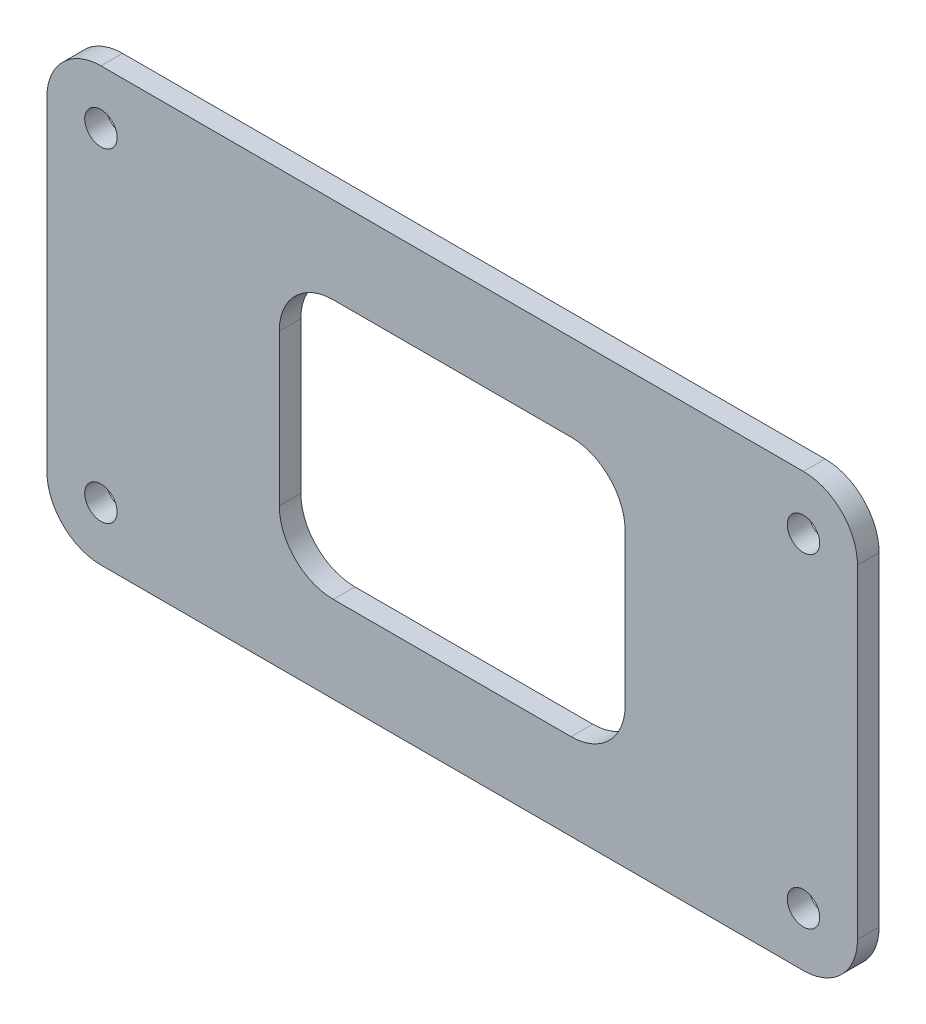
ISO-10303-21;
HEADER;
FILE_DESCRIPTION(('STEP AP214'),'2;1');
FILE_NAME('part.step','',(''),(''),'','','');
FILE_SCHEMA(('AUTOMOTIVE_DESIGN { 1 0 10303 214 1 1 1 1 }'));
ENDSEC;
DATA;
#1=APPLICATION_CONTEXT('core data for automotive mechanical design processes');
#2=APPLICATION_PROTOCOL_DEFINITION('international standard','automotive_design',2000,#1);
#3=PRODUCT_CONTEXT('',#1,'mechanical');
#4=PRODUCT('Part','Part','',(#3));
#5=PRODUCT_RELATED_PRODUCT_CATEGORY('part','',(#4));
#6=PRODUCT_DEFINITION_FORMATION('','',#4);
#7=PRODUCT_DEFINITION_CONTEXT('part definition',#1,'design');
#8=PRODUCT_DEFINITION('design','',#6,#7);
#9=PRODUCT_DEFINITION_SHAPE('','',#8);
#10=(LENGTH_UNIT() NAMED_UNIT(*) SI_UNIT(.MILLI.,.METRE.));
#11=(NAMED_UNIT(*) PLANE_ANGLE_UNIT() SI_UNIT($,.RADIAN.));
#12=(NAMED_UNIT(*) SI_UNIT($,.STERADIAN.) SOLID_ANGLE_UNIT());
#13=UNCERTAINTY_MEASURE_WITH_UNIT(LENGTH_MEASURE(1.E-05),#10,'distance_accuracy_value','');
#14=(GEOMETRIC_REPRESENTATION_CONTEXT(3) GLOBAL_UNCERTAINTY_ASSIGNED_CONTEXT((#13)) GLOBAL_UNIT_ASSIGNED_CONTEXT((#10,
#11,#12)) REPRESENTATION_CONTEXT('',''));
#15=CARTESIAN_POINT('',(0.,0.,0.));
#16=DIRECTION('',(0.,0.,1.));
#17=DIRECTION('',(1.,0.,0.));
#18=AXIS2_PLACEMENT_3D('',#15,#16,#17);
#19=CARTESIAN_POINT('',(32.5,15.,2.));
#20=DIRECTION('',(0.,0.,-1.));
#21=DIRECTION('',(-1.,0.,0.));
#22=AXIS2_PLACEMENT_3D('',#19,#20,#21);
#23=PLANE('',#22);
#24=CARTESIAN_POINT('',(32.5,15.,2.));
#25=DIRECTION('',(0.,0.,1.));
#26=DIRECTION('',(-1.,0.,0.));
#27=AXIS2_PLACEMENT_3D('',#24,#25,#26);
#28=CIRCLE('',#27,5.);
#29=CARTESIAN_POINT('',(37.5,15.,2.));
#30=VERTEX_POINT('',#29);
#31=CARTESIAN_POINT('',(32.5,20.,2.));
#32=VERTEX_POINT('',#31);
#33=EDGE_CURVE('E215',#30,#32,#28,.T.);
#34=ORIENTED_EDGE('',*,*,#33,.T.);
#35=DIRECTION('',(-1.,0.,0.));
#36=VECTOR('',#35,1.);
#37=CARTESIAN_POINT('',(32.5,20.,2.));
#38=LINE('',#37,#36);
#39=CARTESIAN_POINT('',(-32.5,20.,2.));
#40=VERTEX_POINT('',#39);
#41=EDGE_CURVE('E218',#32,#40,#38,.T.);
#42=ORIENTED_EDGE('',*,*,#41,.T.);
#43=CARTESIAN_POINT('',(-32.5,15.,2.));
#44=DIRECTION('',(0.,0.,1.));
#45=DIRECTION('',(1.,0.,0.));
#46=AXIS2_PLACEMENT_3D('',#43,#44,#45);
#47=CIRCLE('',#46,5.);
#48=CARTESIAN_POINT('',(-37.5,15.,2.));
#49=VERTEX_POINT('',#48);
#50=EDGE_CURVE('E221',#40,#49,#47,.T.);
#51=ORIENTED_EDGE('',*,*,#50,.T.);
#52=DIRECTION('',(0.,-1.,0.));
#53=VECTOR('',#52,1.);
#54=CARTESIAN_POINT('',(-37.5,15.,2.));
#55=LINE('',#54,#53);
#56=CARTESIAN_POINT('',(-37.5,-15.,2.));
#57=VERTEX_POINT('',#56);
#58=EDGE_CURVE('E223',#49,#57,#55,.T.);
#59=ORIENTED_EDGE('',*,*,#58,.T.);
#60=CARTESIAN_POINT('',(-32.5,-15.,2.));
#61=DIRECTION('',(0.,0.,1.));
#62=DIRECTION('',(-1.,0.,0.));
#63=AXIS2_PLACEMENT_3D('',#60,#61,#62);
#64=CIRCLE('',#63,5.);
#65=CARTESIAN_POINT('',(-32.5,-20.,2.));
#66=VERTEX_POINT('',#65);
#67=EDGE_CURVE('E225',#57,#66,#64,.T.);
#68=ORIENTED_EDGE('',*,*,#67,.T.);
#69=DIRECTION('',(1.,0.,0.));
#70=VECTOR('',#69,1.);
#71=CARTESIAN_POINT('',(32.5,-20.,2.));
#72=LINE('',#71,#70);
#73=CARTESIAN_POINT('',(32.5,-20.,2.));
#74=VERTEX_POINT('',#73);
#75=EDGE_CURVE('E227',#66,#74,#72,.T.);
#76=ORIENTED_EDGE('',*,*,#75,.T.);
#77=CARTESIAN_POINT('',(32.5,-15.,2.));
#78=DIRECTION('',(0.,0.,1.));
#79=DIRECTION('',(-1.,0.,0.));
#80=AXIS2_PLACEMENT_3D('',#77,#78,#79);
#81=CIRCLE('',#80,5.);
#82=CARTESIAN_POINT('',(37.5,-15.,2.));
#83=VERTEX_POINT('',#82);
#84=EDGE_CURVE('E229',#74,#83,#81,.T.);
#85=ORIENTED_EDGE('',*,*,#84,.T.);
#86=DIRECTION('',(0.,1.,0.));
#87=VECTOR('',#86,1.);
#88=CARTESIAN_POINT('',(37.5,15.,2.));
#89=LINE('',#88,#87);
#90=EDGE_CURVE('E231',#83,#30,#89,.T.);
#91=ORIENTED_EDGE('',*,*,#90,.T.);
#92=EDGE_LOOP('',(#34,#42,#51,#59,#68,#76,#85,#91));
#93=FACE_BOUND('',#92,.T.);
#94=CARTESIAN_POINT('',(-11.,-7.,2.));
#95=DIRECTION('',(0.,0.,1.));
#96=DIRECTION('',(1.,0.,0.));
#97=AXIS2_PLACEMENT_3D('',#94,#95,#96);
#98=CIRCLE('',#97,5.);
#99=CARTESIAN_POINT('',(-16.,-6.99999999999996,2.));
#100=VERTEX_POINT('',#99);
#101=CARTESIAN_POINT('',(-11.,-12.,2.));
#102=VERTEX_POINT('',#101);
#103=EDGE_CURVE('E147',#100,#102,#98,.T.);
#104=ORIENTED_EDGE('',*,*,#103,.F.);
#105=DIRECTION('',(0.,-1.,0.));
#106=VECTOR('',#105,1.);
#107=CARTESIAN_POINT('',(-16.,6.99999999999997,2.));
#108=LINE('',#107,#106);
#109=CARTESIAN_POINT('',(-16.,6.99999999999997,2.));
#110=VERTEX_POINT('',#109);
#111=EDGE_CURVE('E182',#110,#100,#108,.T.);
#112=ORIENTED_EDGE('',*,*,#111,.F.);
#113=CARTESIAN_POINT('',(-11.,7.00000000000001,2.));
#114=DIRECTION('',(0.,0.,1.));
#115=DIRECTION('',(1.,0.,0.));
#116=AXIS2_PLACEMENT_3D('',#113,#114,#115);
#117=CIRCLE('',#116,5.);
#118=CARTESIAN_POINT('',(-11.,12.,2.));
#119=VERTEX_POINT('',#118);
#120=EDGE_CURVE('E180',#119,#110,#117,.T.);
#121=ORIENTED_EDGE('',*,*,#120,.F.);
#122=DIRECTION('',(-1.,0.,0.));
#123=VECTOR('',#122,1.);
#124=CARTESIAN_POINT('',(-11.,12.,2.));
#125=LINE('',#124,#123);
#126=CARTESIAN_POINT('',(11.,12.,2.));
#127=VERTEX_POINT('',#126);
#128=EDGE_CURVE('E178',#127,#119,#125,.T.);
#129=ORIENTED_EDGE('',*,*,#128,.F.);
#130=CARTESIAN_POINT('',(11.,7.00000000000001,2.));
#131=DIRECTION('',(0.,0.,1.));
#132=DIRECTION('',(-1.,0.,0.));
#133=AXIS2_PLACEMENT_3D('',#130,#131,#132);
#134=CIRCLE('',#133,5.);
#135=CARTESIAN_POINT('',(16.,6.99999999999997,2.));
#136=VERTEX_POINT('',#135);
#137=EDGE_CURVE('E176',#136,#127,#134,.T.);
#138=ORIENTED_EDGE('',*,*,#137,.F.);
#139=DIRECTION('',(0.,1.,0.));
#140=VECTOR('',#139,1.);
#141=CARTESIAN_POINT('',(16.,6.99999999999997,2.));
#142=LINE('',#141,#140);
#143=CARTESIAN_POINT('',(16.,-6.99999999999996,2.));
#144=VERTEX_POINT('',#143);
#145=EDGE_CURVE('E171',#144,#136,#142,.T.);
#146=ORIENTED_EDGE('',*,*,#145,.F.);
#147=CARTESIAN_POINT('',(11.,-7.,2.));
#148=DIRECTION('',(0.,0.,1.));
#149=DIRECTION('',(1.,0.,0.));
#150=AXIS2_PLACEMENT_3D('',#147,#148,#149);
#151=CIRCLE('',#150,5.);
#152=CARTESIAN_POINT('',(11.,-12.,2.));
#153=VERTEX_POINT('',#152);
#154=EDGE_CURVE('E169',#153,#144,#151,.T.);
#155=ORIENTED_EDGE('',*,*,#154,.F.);
#156=DIRECTION('',(1.,0.,0.));
#157=VECTOR('',#156,1.);
#158=CARTESIAN_POINT('',(-11.,-12.,2.));
#159=LINE('',#158,#157);
#160=EDGE_CURVE('E155',#102,#153,#159,.T.);
#161=ORIENTED_EDGE('',*,*,#160,.F.);
#162=EDGE_LOOP('',(#104,#112,#121,#129,#138,#146,#155,#161));
#163=FACE_BOUND('',#162,.T.);
#164=CARTESIAN_POINT('',(-32.5,-15.,2.));
#165=DIRECTION('',(0.,0.,1.));
#166=DIRECTION('',(1.,0.,0.));
#167=AXIS2_PLACEMENT_3D('',#164,#165,#166);
#168=CIRCLE('',#167,1.5);
#169=CARTESIAN_POINT('',(-31.,-15.,2.));
#170=VERTEX_POINT('',#169);
#171=EDGE_CURVE('E185',#170,#170,#168,.T.);
#172=ORIENTED_EDGE('',*,*,#171,.F.);
#173=EDGE_LOOP('',(#172));
#174=FACE_BOUND('',#173,.T.);
#175=CARTESIAN_POINT('',(-32.5,15.,2.));
#176=DIRECTION('',(0.,0.,1.));
#177=DIRECTION('',(1.,0.,0.));
#178=AXIS2_PLACEMENT_3D('',#175,#176,#177);
#179=CIRCLE('',#178,1.5);
#180=CARTESIAN_POINT('',(-31.,15.,2.));
#181=VERTEX_POINT('',#180);
#182=EDGE_CURVE('E393',#181,#181,#179,.T.);
#183=ORIENTED_EDGE('',*,*,#182,.F.);
#184=EDGE_LOOP('',(#183));
#185=FACE_BOUND('',#184,.T.);
#186=CARTESIAN_POINT('',(32.5,15.,2.));
#187=DIRECTION('',(0.,0.,1.));
#188=DIRECTION('',(1.,0.,0.));
#189=AXIS2_PLACEMENT_3D('',#186,#187,#188);
#190=CIRCLE('',#189,1.5);
#191=CARTESIAN_POINT('',(34.,15.,2.));
#192=VERTEX_POINT('',#191);
#193=EDGE_CURVE('E387',#192,#192,#190,.T.);
#194=ORIENTED_EDGE('',*,*,#193,.F.);
#195=EDGE_LOOP('',(#194));
#196=FACE_BOUND('',#195,.T.);
#197=CARTESIAN_POINT('',(32.5,-15.,2.));
#198=DIRECTION('',(0.,0.,1.));
#199=DIRECTION('',(1.,0.,0.));
#200=AXIS2_PLACEMENT_3D('',#197,#198,#199);
#201=CIRCLE('',#200,1.5);
#202=CARTESIAN_POINT('',(34.,-15.,2.));
#203=VERTEX_POINT('',#202);
#204=EDGE_CURVE('E378',#203,#203,#201,.T.);
#205=ORIENTED_EDGE('',*,*,#204,.F.);
#206=EDGE_LOOP('',(#205));
#207=FACE_BOUND('',#206,.T.);
#208=ADVANCED_FACE('F34',(#93,#163,#174,#185,#196,#207),#23,.F.);
#209=CARTESIAN_POINT('',(32.5,15.,0.));
#210=DIRECTION('',(0.,0.,-1.));
#211=DIRECTION('',(-1.,0.,0.));
#212=AXIS2_PLACEMENT_3D('',#209,#210,#211);
#213=PLANE('',#212);
#214=CARTESIAN_POINT('',(32.5,15.,0.));
#215=DIRECTION('',(0.,0.,1.));
#216=DIRECTION('',(1.,0.,0.));
#217=AXIS2_PLACEMENT_3D('',#214,#215,#216);
#218=CIRCLE('',#217,1.5);
#219=CARTESIAN_POINT('',(34.,15.,0.));
#220=VERTEX_POINT('',#219);
#221=EDGE_CURVE('E384',#220,#220,#218,.T.);
#222=ORIENTED_EDGE('',*,*,#221,.T.);
#223=EDGE_LOOP('',(#222));
#224=FACE_BOUND('',#223,.T.);
#225=CARTESIAN_POINT('',(-32.5,-15.,0.));
#226=DIRECTION('',(0.,0.,1.));
#227=DIRECTION('',(1.,0.,0.));
#228=AXIS2_PLACEMENT_3D('',#225,#226,#227);
#229=CIRCLE('',#228,1.5);
#230=CARTESIAN_POINT('',(-31.,-15.,0.));
#231=VERTEX_POINT('',#230);
#232=EDGE_CURVE('E396',#231,#231,#229,.T.);
#233=ORIENTED_EDGE('',*,*,#232,.T.);
#234=EDGE_LOOP('',(#233));
#235=FACE_BOUND('',#234,.T.);
#236=CARTESIAN_POINT('',(32.5,15.,0.));
#237=DIRECTION('',(0.,0.,1.));
#238=DIRECTION('',(-1.,0.,0.));
#239=AXIS2_PLACEMENT_3D('',#236,#237,#238);
#240=CIRCLE('',#239,5.);
#241=CARTESIAN_POINT('',(37.5,15.,0.));
#242=VERTEX_POINT('',#241);
#243=CARTESIAN_POINT('',(32.5,20.,0.));
#244=VERTEX_POINT('',#243);
#245=EDGE_CURVE('E163',#242,#244,#240,.T.);
#246=ORIENTED_EDGE('',*,*,#245,.F.);
#247=DIRECTION('',(0.,1.,0.));
#248=VECTOR('',#247,1.);
#249=CARTESIAN_POINT('',(37.5,15.,0.));
#250=LINE('',#249,#248);
#251=CARTESIAN_POINT('',(37.5,-15.,0.));
#252=VERTEX_POINT('',#251);
#253=EDGE_CURVE('E219',#252,#242,#250,.T.);
#254=ORIENTED_EDGE('',*,*,#253,.F.);
#255=CARTESIAN_POINT('',(32.5,-15.,0.));
#256=DIRECTION('',(0.,0.,1.));
#257=DIRECTION('',(-1.,0.,0.));
#258=AXIS2_PLACEMENT_3D('',#255,#256,#257);
#259=CIRCLE('',#258,5.);
#260=CARTESIAN_POINT('',(32.5,-20.,0.));
#261=VERTEX_POINT('',#260);
#262=EDGE_CURVE('E246',#261,#252,#259,.T.);
#263=ORIENTED_EDGE('',*,*,#262,.F.);
#264=DIRECTION('',(1.,0.,0.));
#265=VECTOR('',#264,1.);
#266=CARTESIAN_POINT('',(32.5,-20.,0.));
#267=LINE('',#266,#265);
#268=CARTESIAN_POINT('',(-32.5,-20.,0.));
#269=VERTEX_POINT('',#268);
#270=EDGE_CURVE('E244',#269,#261,#267,.T.);
#271=ORIENTED_EDGE('',*,*,#270,.F.);
#272=CARTESIAN_POINT('',(-32.5,-15.,0.));
#273=DIRECTION('',(0.,0.,1.));
#274=DIRECTION('',(-1.,0.,0.));
#275=AXIS2_PLACEMENT_3D('',#272,#273,#274);
#276=CIRCLE('',#275,5.);
#277=CARTESIAN_POINT('',(-37.5,-15.,0.));
#278=VERTEX_POINT('',#277);
#279=EDGE_CURVE('E242',#278,#269,#276,.T.);
#280=ORIENTED_EDGE('',*,*,#279,.F.);
#281=DIRECTION('',(0.,-1.,0.));
#282=VECTOR('',#281,1.);
#283=CARTESIAN_POINT('',(-37.5,15.,0.));
#284=LINE('',#283,#282);
#285=CARTESIAN_POINT('',(-37.5,15.,0.));
#286=VERTEX_POINT('',#285);
#287=EDGE_CURVE('E240',#286,#278,#284,.T.);
#288=ORIENTED_EDGE('',*,*,#287,.F.);
#289=CARTESIAN_POINT('',(-32.5,15.,0.));
#290=DIRECTION('',(0.,0.,1.));
#291=DIRECTION('',(1.,0.,0.));
#292=AXIS2_PLACEMENT_3D('',#289,#290,#291);
#293=CIRCLE('',#292,5.);
#294=CARTESIAN_POINT('',(-32.5,20.,0.));
#295=VERTEX_POINT('',#294);
#296=EDGE_CURVE('E238',#295,#286,#293,.T.);
#297=ORIENTED_EDGE('',*,*,#296,.F.);
#298=DIRECTION('',(-1.,0.,0.));
#299=VECTOR('',#298,1.);
#300=CARTESIAN_POINT('',(32.5,20.,0.));
#301=LINE('',#300,#299);
#302=EDGE_CURVE('E236',#244,#295,#301,.T.);
#303=ORIENTED_EDGE('',*,*,#302,.F.);
#304=EDGE_LOOP('',(#246,#254,#263,#271,#280,#288,#297,#303));
#305=FACE_BOUND('',#304,.T.);
#306=DIRECTION('',(0.,-1.,0.));
#307=VECTOR('',#306,1.);
#308=CARTESIAN_POINT('',(-16.,6.99999999999997,0.));
#309=LINE('',#308,#307);
#310=CARTESIAN_POINT('',(-16.,6.99999999999997,0.));
#311=VERTEX_POINT('',#310);
#312=CARTESIAN_POINT('',(-16.,-6.99999999999996,0.));
#313=VERTEX_POINT('',#312);
#314=EDGE_CURVE('E156',#311,#313,#309,.T.);
#315=ORIENTED_EDGE('',*,*,#314,.T.);
#316=CARTESIAN_POINT('',(-11.,-7.,0.));
#317=DIRECTION('',(0.,0.,1.));
#318=DIRECTION('',(1.,0.,0.));
#319=AXIS2_PLACEMENT_3D('',#316,#317,#318);
#320=CIRCLE('',#319,5.);
#321=CARTESIAN_POINT('',(-11.,-12.,0.));
#322=VERTEX_POINT('',#321);
#323=EDGE_CURVE('E57',#313,#322,#320,.T.);
#324=ORIENTED_EDGE('',*,*,#323,.T.);
#325=DIRECTION('',(1.,0.,0.));
#326=VECTOR('',#325,1.);
#327=CARTESIAN_POINT('',(-11.,-12.,0.));
#328=LINE('',#327,#326);
#329=CARTESIAN_POINT('',(11.,-12.,0.));
#330=VERTEX_POINT('',#329);
#331=EDGE_CURVE('E162',#322,#330,#328,.T.);
#332=ORIENTED_EDGE('',*,*,#331,.T.);
#333=CARTESIAN_POINT('',(11.,-7.,0.));
#334=DIRECTION('',(0.,0.,1.));
#335=DIRECTION('',(1.,0.,0.));
#336=AXIS2_PLACEMENT_3D('',#333,#334,#335);
#337=CIRCLE('',#336,5.);
#338=CARTESIAN_POINT('',(16.,-6.99999999999996,0.));
#339=VERTEX_POINT('',#338);
#340=EDGE_CURVE('E187',#330,#339,#337,.T.);
#341=ORIENTED_EDGE('',*,*,#340,.T.);
#342=DIRECTION('',(0.,1.,0.));
#343=VECTOR('',#342,1.);
#344=CARTESIAN_POINT('',(16.,6.99999999999997,0.));
#345=LINE('',#344,#343);
#346=CARTESIAN_POINT('',(16.,6.99999999999997,0.));
#347=VERTEX_POINT('',#346);
#348=EDGE_CURVE('E190',#339,#347,#345,.T.);
#349=ORIENTED_EDGE('',*,*,#348,.T.);
#350=CARTESIAN_POINT('',(11.,7.00000000000001,0.));
#351=DIRECTION('',(0.,0.,1.));
#352=DIRECTION('',(-1.,0.,0.));
#353=AXIS2_PLACEMENT_3D('',#350,#351,#352);
#354=CIRCLE('',#353,5.);
#355=CARTESIAN_POINT('',(11.,12.,0.));
#356=VERTEX_POINT('',#355);
#357=EDGE_CURVE('E193',#347,#356,#354,.T.);
#358=ORIENTED_EDGE('',*,*,#357,.T.);
#359=DIRECTION('',(-1.,0.,0.));
#360=VECTOR('',#359,1.);
#361=CARTESIAN_POINT('',(-11.,12.,0.));
#362=LINE('',#361,#360);
#363=CARTESIAN_POINT('',(-11.,12.,0.));
#364=VERTEX_POINT('',#363);
#365=EDGE_CURVE('E196',#356,#364,#362,.T.);
#366=ORIENTED_EDGE('',*,*,#365,.T.);
#367=CARTESIAN_POINT('',(-11.,7.00000000000001,0.));
#368=DIRECTION('',(0.,0.,1.));
#369=DIRECTION('',(1.,0.,0.));
#370=AXIS2_PLACEMENT_3D('',#367,#368,#369);
#371=CIRCLE('',#370,5.);
#372=EDGE_CURVE('E199',#364,#311,#371,.T.);
#373=ORIENTED_EDGE('',*,*,#372,.T.);
#374=EDGE_LOOP('',(#315,#324,#332,#341,#349,#358,#366,#373));
#375=FACE_BOUND('',#374,.T.);
#376=CARTESIAN_POINT('',(-32.5,15.,0.));
#377=DIRECTION('',(0.,0.,1.));
#378=DIRECTION('',(1.,0.,0.));
#379=AXIS2_PLACEMENT_3D('',#376,#377,#378);
#380=CIRCLE('',#379,1.5);
#381=CARTESIAN_POINT('',(-31.,15.,0.));
#382=VERTEX_POINT('',#381);
#383=EDGE_CURVE('E390',#382,#382,#380,.T.);
#384=ORIENTED_EDGE('',*,*,#383,.T.);
#385=EDGE_LOOP('',(#384));
#386=FACE_BOUND('',#385,.T.);
#387=CARTESIAN_POINT('',(32.5,-15.,0.));
#388=DIRECTION('',(0.,0.,1.));
#389=DIRECTION('',(1.,0.,0.));
#390=AXIS2_PLACEMENT_3D('',#387,#388,#389);
#391=CIRCLE('',#390,1.5);
#392=CARTESIAN_POINT('',(34.,-15.,0.));
#393=VERTEX_POINT('',#392);
#394=EDGE_CURVE('E381',#393,#393,#391,.T.);
#395=ORIENTED_EDGE('',*,*,#394,.T.);
#396=EDGE_LOOP('',(#395));
#397=FACE_BOUND('',#396,.T.);
#398=ADVANCED_FACE('F276',(#224,#235,#305,#375,#386,#397),#213,.T.);
#399=CARTESIAN_POINT('',(32.5,15.,2.));
#400=DIRECTION('',(0.,0.,-1.));
#401=DIRECTION('',(-1.,0.,0.));
#402=AXIS2_PLACEMENT_3D('',#399,#400,#401);
#403=CYLINDRICAL_SURFACE('',#402,5.);
#404=ORIENTED_EDGE('',*,*,#245,.T.);
#405=DIRECTION('',(0.,0.,-1.));
#406=VECTOR('',#405,1.);
#407=CARTESIAN_POINT('',(32.5,20.,2.));
#408=LINE('',#407,#406);
#409=EDGE_CURVE('E11',#32,#244,#408,.T.);
#410=ORIENTED_EDGE('',*,*,#409,.F.);
#411=ORIENTED_EDGE('',*,*,#33,.F.);
#412=DIRECTION('',(0.,0.,-1.));
#413=VECTOR('',#412,1.);
#414=CARTESIAN_POINT('',(37.5,15.,2.));
#415=LINE('',#414,#413);
#416=EDGE_CURVE('E233',#30,#242,#415,.T.);
#417=ORIENTED_EDGE('',*,*,#416,.T.);
#418=EDGE_LOOP('',(#404,#410,#411,#417));
#419=FACE_BOUND('',#418,.T.);
#420=ADVANCED_FACE('F36',(#419),#403,.T.);
#421=CARTESIAN_POINT('',(32.5,20.,2.));
#422=DIRECTION('',(0.,-1.,0.));
#423=DIRECTION('',(0.,0.,-1.));
#424=AXIS2_PLACEMENT_3D('',#421,#422,#423);
#425=PLANE('',#424);
#426=ORIENTED_EDGE('',*,*,#302,.T.);
#427=DIRECTION('',(0.,0.,-1.));
#428=VECTOR('',#427,1.);
#429=CARTESIAN_POINT('',(-32.5,20.,2.));
#430=LINE('',#429,#428);
#431=EDGE_CURVE('E42',#40,#295,#430,.T.);
#432=ORIENTED_EDGE('',*,*,#431,.F.);
#433=ORIENTED_EDGE('',*,*,#41,.F.);
#434=ORIENTED_EDGE('',*,*,#409,.T.);
#435=EDGE_LOOP('',(#426,#432,#433,#434));
#436=FACE_BOUND('',#435,.T.);
#437=ADVANCED_FACE('F293',(#436),#425,.F.);
#438=CARTESIAN_POINT('',(-32.5,15.,2.));
#439=DIRECTION('',(0.,0.,-1.));
#440=DIRECTION('',(-1.,0.,0.));
#441=AXIS2_PLACEMENT_3D('',#438,#439,#440);
#442=CYLINDRICAL_SURFACE('',#441,5.);
#443=ORIENTED_EDGE('',*,*,#296,.T.);
#444=DIRECTION('',(0.,0.,-1.));
#445=VECTOR('',#444,1.);
#446=CARTESIAN_POINT('',(-37.5,15.,2.));
#447=LINE('',#446,#445);
#448=EDGE_CURVE('E263',#49,#286,#447,.T.);
#449=ORIENTED_EDGE('',*,*,#448,.F.);
#450=ORIENTED_EDGE('',*,*,#50,.F.);
#451=ORIENTED_EDGE('',*,*,#431,.T.);
#452=EDGE_LOOP('',(#443,#449,#450,#451));
#453=FACE_BOUND('',#452,.T.);
#454=ADVANCED_FACE('F270',(#453),#442,.T.);
#455=CARTESIAN_POINT('',(-37.5,15.,2.));
#456=DIRECTION('',(1.,0.,0.));
#457=DIRECTION('',(0.,0.,-1.));
#458=AXIS2_PLACEMENT_3D('',#455,#456,#457);
#459=PLANE('',#458);
#460=ORIENTED_EDGE('',*,*,#287,.T.);
#461=DIRECTION('',(0.,0.,-1.));
#462=VECTOR('',#461,1.);
#463=CARTESIAN_POINT('',(-37.5,-15.,2.));
#464=LINE('',#463,#462);
#465=EDGE_CURVE('E260',#57,#278,#464,.T.);
#466=ORIENTED_EDGE('',*,*,#465,.F.);
#467=ORIENTED_EDGE('',*,*,#58,.F.);
#468=ORIENTED_EDGE('',*,*,#448,.T.);
#469=EDGE_LOOP('',(#460,#466,#467,#468));
#470=FACE_BOUND('',#469,.T.);
#471=ADVANCED_FACE('F282',(#470),#459,.F.);
#472=CARTESIAN_POINT('',(-32.5,-15.,2.));
#473=DIRECTION('',(0.,0.,-1.));
#474=DIRECTION('',(-1.,0.,0.));
#475=AXIS2_PLACEMENT_3D('',#472,#473,#474);
#476=CYLINDRICAL_SURFACE('',#475,5.);
#477=ORIENTED_EDGE('',*,*,#279,.T.);
#478=DIRECTION('',(0.,0.,-1.));
#479=VECTOR('',#478,1.);
#480=CARTESIAN_POINT('',(-32.5,-20.,2.));
#481=LINE('',#480,#479);
#482=EDGE_CURVE('E257',#66,#269,#481,.T.);
#483=ORIENTED_EDGE('',*,*,#482,.F.);
#484=ORIENTED_EDGE('',*,*,#67,.F.);
#485=ORIENTED_EDGE('',*,*,#465,.T.);
#486=EDGE_LOOP('',(#477,#483,#484,#485));
#487=FACE_BOUND('',#486,.T.);
#488=ADVANCED_FACE('F286',(#487),#476,.T.);
#489=CARTESIAN_POINT('',(32.5,-20.,2.));
#490=DIRECTION('',(0.,1.,0.));
#491=DIRECTION('',(-1.,0.,0.));
#492=AXIS2_PLACEMENT_3D('',#489,#490,#491);
#493=PLANE('',#492);
#494=ORIENTED_EDGE('',*,*,#270,.T.);
#495=DIRECTION('',(0.,0.,-1.));
#496=VECTOR('',#495,1.);
#497=CARTESIAN_POINT('',(32.5,-20.,2.));
#498=LINE('',#497,#496);
#499=EDGE_CURVE('E254',#74,#261,#498,.T.);
#500=ORIENTED_EDGE('',*,*,#499,.F.);
#501=ORIENTED_EDGE('',*,*,#75,.F.);
#502=ORIENTED_EDGE('',*,*,#482,.T.);
#503=EDGE_LOOP('',(#494,#500,#501,#502));
#504=FACE_BOUND('',#503,.T.);
#505=ADVANCED_FACE('F306',(#504),#493,.F.);
#506=CARTESIAN_POINT('',(32.5,-15.,2.));
#507=DIRECTION('',(0.,0.,-1.));
#508=DIRECTION('',(-1.,0.,0.));
#509=AXIS2_PLACEMENT_3D('',#506,#507,#508);
#510=CYLINDRICAL_SURFACE('',#509,5.);
#511=ORIENTED_EDGE('',*,*,#262,.T.);
#512=DIRECTION('',(0.,0.,-1.));
#513=VECTOR('',#512,1.);
#514=CARTESIAN_POINT('',(37.5,-15.,2.));
#515=LINE('',#514,#513);
#516=EDGE_CURVE('E251',#83,#252,#515,.T.);
#517=ORIENTED_EDGE('',*,*,#516,.F.);
#518=ORIENTED_EDGE('',*,*,#84,.F.);
#519=ORIENTED_EDGE('',*,*,#499,.T.);
#520=EDGE_LOOP('',(#511,#517,#518,#519));
#521=FACE_BOUND('',#520,.T.);
#522=ADVANCED_FACE('F304',(#521),#510,.T.);
#523=CARTESIAN_POINT('',(37.5,15.,2.));
#524=DIRECTION('',(-1.,0.,0.));
#525=DIRECTION('',(0.,0.,1.));
#526=AXIS2_PLACEMENT_3D('',#523,#524,#525);
#527=PLANE('',#526);
#528=ORIENTED_EDGE('',*,*,#253,.T.);
#529=ORIENTED_EDGE('',*,*,#416,.F.);
#530=ORIENTED_EDGE('',*,*,#90,.F.);
#531=ORIENTED_EDGE('',*,*,#516,.T.);
#532=EDGE_LOOP('',(#528,#529,#530,#531));
#533=FACE_BOUND('',#532,.T.);
#534=ADVANCED_FACE('F299',(#533),#527,.F.);
#535=CARTESIAN_POINT('',(-11.,-7.,2.));
#536=DIRECTION('',(0.,0.,-1.));
#537=DIRECTION('',(-1.,0.,0.));
#538=AXIS2_PLACEMENT_3D('',#535,#536,#537);
#539=CYLINDRICAL_SURFACE('',#538,5.);
#540=ORIENTED_EDGE('',*,*,#323,.F.);
#541=DIRECTION('',(0.,0.,-1.));
#542=VECTOR('',#541,1.);
#543=CARTESIAN_POINT('',(-16.,-6.99999999999996,2.));
#544=LINE('',#543,#542);
#545=EDGE_CURVE('E151',#100,#313,#544,.T.);
#546=ORIENTED_EDGE('',*,*,#545,.F.);
#547=ORIENTED_EDGE('',*,*,#103,.T.);
#548=DIRECTION('',(0.,0.,-1.));
#549=VECTOR('',#548,1.);
#550=CARTESIAN_POINT('',(-11.,-12.,2.));
#551=LINE('',#550,#549);
#552=EDGE_CURVE('E150',#102,#322,#551,.T.);
#553=ORIENTED_EDGE('',*,*,#552,.T.);
#554=EDGE_LOOP('',(#540,#546,#547,#553));
#555=FACE_BOUND('',#554,.T.);
#556=ADVANCED_FACE('F149',(#555),#539,.F.);
#557=CARTESIAN_POINT('',(-11.,-12.,2.));
#558=DIRECTION('',(0.,1.,0.));
#559=DIRECTION('',(0.,0.,1.));
#560=AXIS2_PLACEMENT_3D('',#557,#558,#559);
#561=PLANE('',#560);
#562=ORIENTED_EDGE('',*,*,#331,.F.);
#563=ORIENTED_EDGE('',*,*,#552,.F.);
#564=ORIENTED_EDGE('',*,*,#160,.T.);
#565=DIRECTION('',(0.,0.,-1.));
#566=VECTOR('',#565,1.);
#567=CARTESIAN_POINT('',(11.,-12.,2.));
#568=LINE('',#567,#566);
#569=EDGE_CURVE('E164',#153,#330,#568,.T.);
#570=ORIENTED_EDGE('',*,*,#569,.T.);
#571=EDGE_LOOP('',(#562,#563,#564,#570));
#572=FACE_BOUND('',#571,.T.);
#573=ADVANCED_FACE('F159',(#572),#561,.T.);
#574=CARTESIAN_POINT('',(11.,-7.,2.));
#575=DIRECTION('',(0.,0.,-1.));
#576=DIRECTION('',(-1.,0.,0.));
#577=AXIS2_PLACEMENT_3D('',#574,#575,#576);
#578=CYLINDRICAL_SURFACE('',#577,5.);
#579=ORIENTED_EDGE('',*,*,#340,.F.);
#580=ORIENTED_EDGE('',*,*,#569,.F.);
#581=ORIENTED_EDGE('',*,*,#154,.T.);
#582=DIRECTION('',(0.,0.,-1.));
#583=VECTOR('',#582,1.);
#584=CARTESIAN_POINT('',(16.,-6.99999999999996,2.));
#585=LINE('',#584,#583);
#586=EDGE_CURVE('E212',#144,#339,#585,.T.);
#587=ORIENTED_EDGE('',*,*,#586,.T.);
#588=EDGE_LOOP('',(#579,#580,#581,#587));
#589=FACE_BOUND('',#588,.T.);
#590=ADVANCED_FACE('F332',(#589),#578,.F.);
#591=CARTESIAN_POINT('',(16.,6.99999999999997,2.));
#592=DIRECTION('',(-1.,0.,0.));
#593=DIRECTION('',(0.,0.,1.));
#594=AXIS2_PLACEMENT_3D('',#591,#592,#593);
#595=PLANE('',#594);
#596=ORIENTED_EDGE('',*,*,#348,.F.);
#597=ORIENTED_EDGE('',*,*,#586,.F.);
#598=ORIENTED_EDGE('',*,*,#145,.T.);
#599=DIRECTION('',(0.,0.,-1.));
#600=VECTOR('',#599,1.);
#601=CARTESIAN_POINT('',(16.,6.99999999999997,2.));
#602=LINE('',#601,#600);
#603=EDGE_CURVE('E210',#136,#347,#602,.T.);
#604=ORIENTED_EDGE('',*,*,#603,.T.);
#605=EDGE_LOOP('',(#596,#597,#598,#604));
#606=FACE_BOUND('',#605,.T.);
#607=ADVANCED_FACE('F336',(#606),#595,.T.);
#608=CARTESIAN_POINT('',(11.,7.00000000000001,2.));
#609=DIRECTION('',(0.,0.,-1.));
#610=DIRECTION('',(-1.,0.,0.));
#611=AXIS2_PLACEMENT_3D('',#608,#609,#610);
#612=CYLINDRICAL_SURFACE('',#611,5.);
#613=ORIENTED_EDGE('',*,*,#357,.F.);
#614=ORIENTED_EDGE('',*,*,#603,.F.);
#615=ORIENTED_EDGE('',*,*,#137,.T.);
#616=DIRECTION('',(0.,0.,-1.));
#617=VECTOR('',#616,1.);
#618=CARTESIAN_POINT('',(11.,12.,2.));
#619=LINE('',#618,#617);
#620=EDGE_CURVE('E208',#127,#356,#619,.T.);
#621=ORIENTED_EDGE('',*,*,#620,.T.);
#622=EDGE_LOOP('',(#613,#614,#615,#621));
#623=FACE_BOUND('',#622,.T.);
#624=ADVANCED_FACE('F342',(#623),#612,.F.);
#625=CARTESIAN_POINT('',(-11.,12.,2.));
#626=DIRECTION('',(0.,-1.,0.));
#627=DIRECTION('',(0.,0.,-1.));
#628=AXIS2_PLACEMENT_3D('',#625,#626,#627);
#629=PLANE('',#628);
#630=ORIENTED_EDGE('',*,*,#365,.F.);
#631=ORIENTED_EDGE('',*,*,#620,.F.);
#632=ORIENTED_EDGE('',*,*,#128,.T.);
#633=DIRECTION('',(0.,0.,-1.));
#634=VECTOR('',#633,1.);
#635=CARTESIAN_POINT('',(-11.,12.,2.));
#636=LINE('',#635,#634);
#637=EDGE_CURVE('E206',#119,#364,#636,.T.);
#638=ORIENTED_EDGE('',*,*,#637,.T.);
#639=EDGE_LOOP('',(#630,#631,#632,#638));
#640=FACE_BOUND('',#639,.T.);
#641=ADVANCED_FACE('F346',(#640),#629,.T.);
#642=CARTESIAN_POINT('',(-11.,7.00000000000001,2.));
#643=DIRECTION('',(0.,0.,-1.));
#644=DIRECTION('',(-1.,0.,0.));
#645=AXIS2_PLACEMENT_3D('',#642,#643,#644);
#646=CYLINDRICAL_SURFACE('',#645,5.);
#647=ORIENTED_EDGE('',*,*,#372,.F.);
#648=ORIENTED_EDGE('',*,*,#637,.F.);
#649=ORIENTED_EDGE('',*,*,#120,.T.);
#650=DIRECTION('',(0.,0.,-1.));
#651=VECTOR('',#650,1.);
#652=CARTESIAN_POINT('',(-16.,6.99999999999997,2.));
#653=LINE('',#652,#651);
#654=EDGE_CURVE('E49',#110,#311,#653,.T.);
#655=ORIENTED_EDGE('',*,*,#654,.T.);
#656=EDGE_LOOP('',(#647,#648,#649,#655));
#657=FACE_BOUND('',#656,.T.);
#658=ADVANCED_FACE('F350',(#657),#646,.F.);
#659=CARTESIAN_POINT('',(-16.,6.99999999999997,2.));
#660=DIRECTION('',(1.,0.,0.));
#661=DIRECTION('',(0.,0.,-1.));
#662=AXIS2_PLACEMENT_3D('',#659,#660,#661);
#663=PLANE('',#662);
#664=ORIENTED_EDGE('',*,*,#314,.F.);
#665=ORIENTED_EDGE('',*,*,#654,.F.);
#666=ORIENTED_EDGE('',*,*,#111,.T.);
#667=ORIENTED_EDGE('',*,*,#545,.T.);
#668=EDGE_LOOP('',(#664,#665,#666,#667));
#669=FACE_BOUND('',#668,.T.);
#670=ADVANCED_FACE('F354',(#669),#663,.T.);
#671=CARTESIAN_POINT('',(-32.5,-15.,2.));
#672=DIRECTION('',(0.,0.,-1.));
#673=DIRECTION('',(-1.,0.,0.));
#674=AXIS2_PLACEMENT_3D('',#671,#672,#673);
#675=CYLINDRICAL_SURFACE('',#674,1.5);
#676=ORIENTED_EDGE('',*,*,#171,.T.);
#677=EDGE_LOOP('',(#676));
#678=FACE_BOUND('',#677,.T.);
#679=ORIENTED_EDGE('',*,*,#232,.F.);
#680=EDGE_LOOP('',(#679));
#681=FACE_BOUND('',#680,.T.);
#682=ADVANCED_FACE('F358',(#678,#681),#675,.F.);
#683=CARTESIAN_POINT('',(-32.5,15.,2.));
#684=DIRECTION('',(0.,0.,-1.));
#685=DIRECTION('',(-1.,0.,0.));
#686=AXIS2_PLACEMENT_3D('',#683,#684,#685);
#687=CYLINDRICAL_SURFACE('',#686,1.5);
#688=ORIENTED_EDGE('',*,*,#182,.T.);
#689=EDGE_LOOP('',(#688));
#690=FACE_BOUND('',#689,.T.);
#691=ORIENTED_EDGE('',*,*,#383,.F.);
#692=EDGE_LOOP('',(#691));
#693=FACE_BOUND('',#692,.T.);
#694=ADVANCED_FACE('F361',(#690,#693),#687,.F.);
#695=CARTESIAN_POINT('',(32.5,15.,2.));
#696=DIRECTION('',(0.,0.,-1.));
#697=DIRECTION('',(-1.,0.,0.));
#698=AXIS2_PLACEMENT_3D('',#695,#696,#697);
#699=CYLINDRICAL_SURFACE('',#698,1.5);
#700=ORIENTED_EDGE('',*,*,#193,.T.);
#701=EDGE_LOOP('',(#700));
#702=FACE_BOUND('',#701,.T.);
#703=ORIENTED_EDGE('',*,*,#221,.F.);
#704=EDGE_LOOP('',(#703));
#705=FACE_BOUND('',#704,.T.);
#706=ADVANCED_FACE('F365',(#702,#705),#699,.F.);
#707=CARTESIAN_POINT('',(32.5,-15.,2.));
#708=DIRECTION('',(0.,0.,-1.));
#709=DIRECTION('',(-1.,0.,0.));
#710=AXIS2_PLACEMENT_3D('',#707,#708,#709);
#711=CYLINDRICAL_SURFACE('',#710,1.5);
#712=ORIENTED_EDGE('',*,*,#204,.T.);
#713=EDGE_LOOP('',(#712));
#714=FACE_BOUND('',#713,.T.);
#715=ORIENTED_EDGE('',*,*,#394,.F.);
#716=EDGE_LOOP('',(#715));
#717=FACE_BOUND('',#716,.T.);
#718=ADVANCED_FACE('F369',(#714,#717),#711,.F.);
#719=CLOSED_SHELL('',(#208,#398,#420,#437,#454,#471,#488,#505,#522,#534,#556,#573,#590,#607,
#624,#641,#658,#670,#682,#694,#706,#718));
#720=MANIFOLD_SOLID_BREP('B2',#719);
#721=ADVANCED_BREP_SHAPE_REPRESENTATION('',(#18,#720),#14);
#722=SHAPE_DEFINITION_REPRESENTATION(#9,#721);
ENDSEC;
END-ISO-10303-21;
